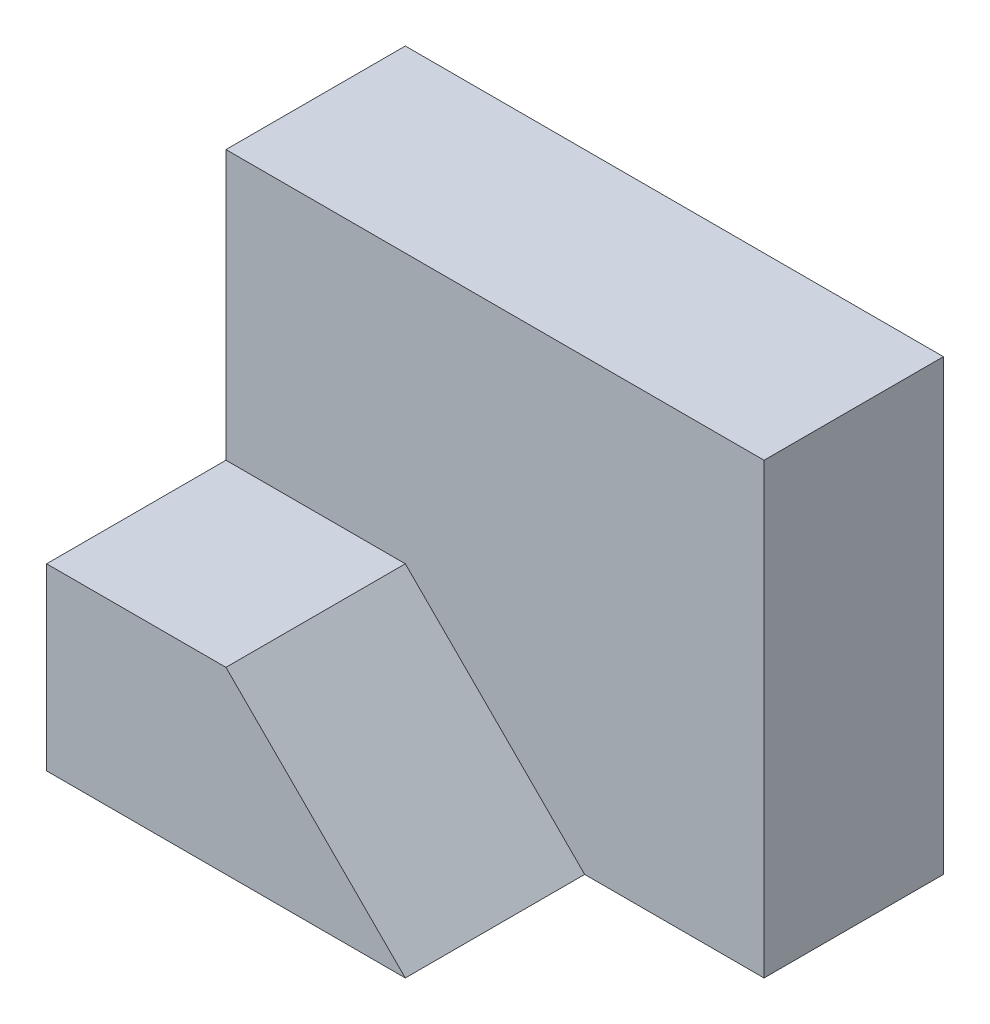
ISO-10303-21;
HEADER;
FILE_DESCRIPTION(('STEP AP214'),'2;1');
FILE_NAME('part.step','',(''),(''),'','','');
FILE_SCHEMA(('AUTOMOTIVE_DESIGN { 1 0 10303 214 1 1 1 1 }'));
ENDSEC;
DATA;
#1=APPLICATION_CONTEXT('core data for automotive mechanical design processes');
#2=APPLICATION_PROTOCOL_DEFINITION('international standard','automotive_design',2000,#1);
#3=PRODUCT_CONTEXT('',#1,'mechanical');
#4=PRODUCT('Part','Part','',(#3));
#5=PRODUCT_RELATED_PRODUCT_CATEGORY('part','',(#4));
#6=PRODUCT_DEFINITION_FORMATION('','',#4);
#7=PRODUCT_DEFINITION_CONTEXT('part definition',#1,'design');
#8=PRODUCT_DEFINITION('design','',#6,#7);
#9=PRODUCT_DEFINITION_SHAPE('','',#8);
#10=(LENGTH_UNIT() NAMED_UNIT(*) SI_UNIT(.MILLI.,.METRE.));
#11=(NAMED_UNIT(*) PLANE_ANGLE_UNIT() SI_UNIT($,.RADIAN.));
#12=(NAMED_UNIT(*) SI_UNIT($,.STERADIAN.) SOLID_ANGLE_UNIT());
#13=UNCERTAINTY_MEASURE_WITH_UNIT(LENGTH_MEASURE(1.E-05),#10,'distance_accuracy_value','');
#14=(GEOMETRIC_REPRESENTATION_CONTEXT(3) GLOBAL_UNCERTAINTY_ASSIGNED_CONTEXT((#13)) GLOBAL_UNIT_ASSIGNED_CONTEXT((#10,
#11,#12)) REPRESENTATION_CONTEXT('',''));
#15=CARTESIAN_POINT('',(0.,0.,0.));
#16=DIRECTION('',(0.,0.,1.));
#17=DIRECTION('',(1.,0.,0.));
#18=AXIS2_PLACEMENT_3D('',#15,#16,#17);
#19=CARTESIAN_POINT('',(0.,0.,2.));
#20=DIRECTION('',(0.,0.,-1.));
#21=DIRECTION('',(-1.,0.,0.));
#22=AXIS2_PLACEMENT_3D('',#19,#20,#21);
#23=PLANE('',#22);
#24=DIRECTION('',(-1.,0.,0.));
#25=VECTOR('',#24,1.);
#26=CARTESIAN_POINT('',(0.,2.,2.));
#27=LINE('',#26,#25);
#28=CARTESIAN_POINT('',(2.,2.,2.));
#29=VERTEX_POINT('',#28);
#30=CARTESIAN_POINT('',(0.,2.,2.));
#31=VERTEX_POINT('',#30);
#32=EDGE_CURVE('E111',#29,#31,#27,.T.);
#33=ORIENTED_EDGE('',*,*,#32,.F.);
#34=DIRECTION('',(-0.707106781186548,0.707106781186547,0.));
#35=VECTOR('',#34,1.);
#36=CARTESIAN_POINT('',(2.,2.,2.));
#37=LINE('',#36,#35);
#38=CARTESIAN_POINT('',(4.,0.,2.));
#39=VERTEX_POINT('',#38);
#40=EDGE_CURVE('E50',#39,#29,#37,.T.);
#41=ORIENTED_EDGE('',*,*,#40,.F.);
#42=DIRECTION('',(1.,0.,0.));
#43=VECTOR('',#42,1.);
#44=CARTESIAN_POINT('',(0.,0.,2.));
#45=LINE('',#44,#43);
#46=CARTESIAN_POINT('',(6.,0.,2.));
#47=VERTEX_POINT('',#46);
#48=EDGE_CURVE('E115',#39,#47,#45,.T.);
#49=ORIENTED_EDGE('',*,*,#48,.T.);
#50=DIRECTION('',(0.,1.,0.));
#51=VECTOR('',#50,1.);
#52=CARTESIAN_POINT('',(6.,0.,2.));
#53=LINE('',#52,#51);
#54=CARTESIAN_POINT('',(6.,5.,2.));
#55=VERTEX_POINT('',#54);
#56=EDGE_CURVE('E142',#47,#55,#53,.T.);
#57=ORIENTED_EDGE('',*,*,#56,.T.);
#58=DIRECTION('',(-1.,0.,0.));
#59=VECTOR('',#58,1.);
#60=CARTESIAN_POINT('',(0.,5.,2.));
#61=LINE('',#60,#59);
#62=CARTESIAN_POINT('',(0.,5.,2.));
#63=VERTEX_POINT('',#62);
#64=EDGE_CURVE('E168',#55,#63,#61,.T.);
#65=ORIENTED_EDGE('',*,*,#64,.T.);
#66=DIRECTION('',(0.,-1.,0.));
#67=VECTOR('',#66,1.);
#68=CARTESIAN_POINT('',(0.,0.,2.));
#69=LINE('',#68,#67);
#70=EDGE_CURVE('E56',#63,#31,#69,.T.);
#71=ORIENTED_EDGE('',*,*,#70,.T.);
#72=EDGE_LOOP('',(#33,#41,#49,#57,#65,#71));
#73=FACE_BOUND('',#72,.T.);
#74=ADVANCED_FACE('F33',(#73),#23,.F.);
#75=CARTESIAN_POINT('',(0.,0.,2.));
#76=DIRECTION('',(1.,0.,0.));
#77=DIRECTION('',(0.,0.,-1.));
#78=AXIS2_PLACEMENT_3D('',#75,#76,#77);
#79=PLANE('',#78);
#80=DIRECTION('',(0.,-1.,0.));
#81=VECTOR('',#80,1.);
#82=CARTESIAN_POINT('',(0.,0.,0.));
#83=LINE('',#82,#81);
#84=CARTESIAN_POINT('',(0.,5.,0.));
#85=VERTEX_POINT('',#84);
#86=CARTESIAN_POINT('',(0.,0.,0.));
#87=VERTEX_POINT('',#86);
#88=EDGE_CURVE('E116',#85,#87,#83,.T.);
#89=ORIENTED_EDGE('',*,*,#88,.T.);
#90=DIRECTION('',(0.,0.,-1.));
#91=VECTOR('',#90,1.);
#92=CARTESIAN_POINT('',(0.,0.,2.));
#93=LINE('',#92,#91);
#94=CARTESIAN_POINT('',(0.,0.,4.));
#95=VERTEX_POINT('',#94);
#96=EDGE_CURVE('E11',#95,#87,#93,.T.);
#97=ORIENTED_EDGE('',*,*,#96,.F.);
#98=DIRECTION('',(0.,-1.,0.));
#99=VECTOR('',#98,1.);
#100=CARTESIAN_POINT('',(0.,0.,4.));
#101=LINE('',#100,#99);
#102=CARTESIAN_POINT('',(0.,2.,4.));
#103=VERTEX_POINT('',#102);
#104=EDGE_CURVE('E109',#103,#95,#101,.T.);
#105=ORIENTED_EDGE('',*,*,#104,.F.);
#106=DIRECTION('',(0.,0.,-1.));
#107=VECTOR('',#106,1.);
#108=CARTESIAN_POINT('',(0.,2.,4.));
#109=LINE('',#108,#107);
#110=EDGE_CURVE('E121',#103,#31,#109,.T.);
#111=ORIENTED_EDGE('',*,*,#110,.T.);
#112=ORIENTED_EDGE('',*,*,#70,.F.);
#113=DIRECTION('',(0.,0.,-1.));
#114=VECTOR('',#113,1.);
#115=CARTESIAN_POINT('',(0.,5.,2.));
#116=LINE('',#115,#114);
#117=EDGE_CURVE('E166',#63,#85,#116,.T.);
#118=ORIENTED_EDGE('',*,*,#117,.T.);
#119=EDGE_LOOP('',(#89,#97,#105,#111,#112,#118));
#120=FACE_BOUND('',#119,.T.);
#121=ADVANCED_FACE('F35',(#120),#79,.F.);
#122=CARTESIAN_POINT('',(0.,0.,2.));
#123=DIRECTION('',(0.,1.,0.));
#124=DIRECTION('',(0.,0.,1.));
#125=AXIS2_PLACEMENT_3D('',#122,#123,#124);
#126=PLANE('',#125);
#127=DIRECTION('',(1.,0.,0.));
#128=VECTOR('',#127,1.);
#129=CARTESIAN_POINT('',(0.,0.,0.));
#130=LINE('',#129,#128);
#131=CARTESIAN_POINT('',(6.,0.,0.));
#132=VERTEX_POINT('',#131);
#133=EDGE_CURVE('E119',#87,#132,#130,.T.);
#134=ORIENTED_EDGE('',*,*,#133,.T.);
#135=DIRECTION('',(0.,0.,-1.));
#136=VECTOR('',#135,1.);
#137=CARTESIAN_POINT('',(6.,0.,2.));
#138=LINE('',#137,#136);
#139=EDGE_CURVE('E42',#47,#132,#138,.T.);
#140=ORIENTED_EDGE('',*,*,#139,.F.);
#141=ORIENTED_EDGE('',*,*,#48,.F.);
#142=DIRECTION('',(0.,0.,-1.));
#143=VECTOR('',#142,1.);
#144=CARTESIAN_POINT('',(4.,0.,4.));
#145=LINE('',#144,#143);
#146=CARTESIAN_POINT('',(4.,0.,4.));
#147=VERTEX_POINT('',#146);
#148=EDGE_CURVE('E97',#147,#39,#145,.T.);
#149=ORIENTED_EDGE('',*,*,#148,.F.);
#150=DIRECTION('',(1.,0.,0.));
#151=VECTOR('',#150,1.);
#152=CARTESIAN_POINT('',(4.,0.,4.));
#153=LINE('',#152,#151);
#154=EDGE_CURVE('E103',#95,#147,#153,.T.);
#155=ORIENTED_EDGE('',*,*,#154,.F.);
#156=ORIENTED_EDGE('',*,*,#96,.T.);
#157=EDGE_LOOP('',(#134,#140,#141,#149,#155,#156));
#158=FACE_BOUND('',#157,.T.);
#159=ADVANCED_FACE('F113',(#158),#126,.F.);
#160=CARTESIAN_POINT('',(6.,0.,2.));
#161=DIRECTION('',(-1.,0.,0.));
#162=DIRECTION('',(0.,0.,1.));
#163=AXIS2_PLACEMENT_3D('',#160,#161,#162);
#164=PLANE('',#163);
#165=DIRECTION('',(0.,1.,0.));
#166=VECTOR('',#165,1.);
#167=CARTESIAN_POINT('',(6.,0.,0.));
#168=LINE('',#167,#166);
#169=CARTESIAN_POINT('',(6.,5.,0.));
#170=VERTEX_POINT('',#169);
#171=EDGE_CURVE('E154',#132,#170,#168,.T.);
#172=ORIENTED_EDGE('',*,*,#171,.T.);
#173=DIRECTION('',(0.,0.,-1.));
#174=VECTOR('',#173,1.);
#175=CARTESIAN_POINT('',(6.,5.,2.));
#176=LINE('',#175,#174);
#177=EDGE_CURVE('E160',#55,#170,#176,.T.);
#178=ORIENTED_EDGE('',*,*,#177,.F.);
#179=ORIENTED_EDGE('',*,*,#56,.F.);
#180=ORIENTED_EDGE('',*,*,#139,.T.);
#181=EDGE_LOOP('',(#172,#178,#179,#180));
#182=FACE_BOUND('',#181,.T.);
#183=ADVANCED_FACE('F157',(#182),#164,.F.);
#184=CARTESIAN_POINT('',(0.,5.,2.));
#185=DIRECTION('',(0.,-1.,0.));
#186=DIRECTION('',(0.,0.,-1.));
#187=AXIS2_PLACEMENT_3D('',#184,#185,#186);
#188=PLANE('',#187);
#189=DIRECTION('',(-1.,0.,0.));
#190=VECTOR('',#189,1.);
#191=CARTESIAN_POINT('',(0.,5.,0.));
#192=LINE('',#191,#190);
#193=EDGE_CURVE('E140',#170,#85,#192,.T.);
#194=ORIENTED_EDGE('',*,*,#193,.T.);
#195=ORIENTED_EDGE('',*,*,#117,.F.);
#196=ORIENTED_EDGE('',*,*,#64,.F.);
#197=ORIENTED_EDGE('',*,*,#177,.T.);
#198=EDGE_LOOP('',(#194,#195,#196,#197));
#199=FACE_BOUND('',#198,.T.);
#200=ADVANCED_FACE('F171',(#199),#188,.F.);
#201=CARTESIAN_POINT('',(0.,0.,0.));
#202=DIRECTION('',(0.,0.,-1.));
#203=DIRECTION('',(-1.,0.,0.));
#204=AXIS2_PLACEMENT_3D('',#201,#202,#203);
#205=PLANE('',#204);
#206=ORIENTED_EDGE('',*,*,#88,.F.);
#207=ORIENTED_EDGE('',*,*,#193,.F.);
#208=ORIENTED_EDGE('',*,*,#171,.F.);
#209=ORIENTED_EDGE('',*,*,#133,.F.);
#210=EDGE_LOOP('',(#206,#207,#208,#209));
#211=FACE_BOUND('',#210,.T.);
#212=ADVANCED_FACE('F162',(#211),#205,.T.);
#213=CARTESIAN_POINT('',(2.,2.,4.));
#214=DIRECTION('',(-0.707106781186547,-0.707106781186548,0.));
#215=DIRECTION('',(0.707106781186548,-0.707106781186547,0.));
#216=AXIS2_PLACEMENT_3D('',#213,#214,#215);
#217=PLANE('',#216);
#218=ORIENTED_EDGE('',*,*,#40,.T.);
#219=DIRECTION('',(0.,0.,-1.));
#220=VECTOR('',#219,1.);
#221=CARTESIAN_POINT('',(2.,2.,4.));
#222=LINE('',#221,#220);
#223=CARTESIAN_POINT('',(2.,2.,4.));
#224=VERTEX_POINT('',#223);
#225=EDGE_CURVE('E99',#224,#29,#222,.T.);
#226=ORIENTED_EDGE('',*,*,#225,.F.);
#227=DIRECTION('',(-0.707106781186548,0.707106781186547,0.));
#228=VECTOR('',#227,1.);
#229=CARTESIAN_POINT('',(2.,2.,4.));
#230=LINE('',#229,#228);
#231=EDGE_CURVE('E93',#147,#224,#230,.T.);
#232=ORIENTED_EDGE('',*,*,#231,.F.);
#233=ORIENTED_EDGE('',*,*,#148,.T.);
#234=EDGE_LOOP('',(#218,#226,#232,#233));
#235=FACE_BOUND('',#234,.T.);
#236=ADVANCED_FACE('F95',(#235),#217,.F.);
#237=CARTESIAN_POINT('',(0.,2.,4.));
#238=DIRECTION('',(0.,-1.,0.));
#239=DIRECTION('',(0.,0.,-1.));
#240=AXIS2_PLACEMENT_3D('',#237,#238,#239);
#241=PLANE('',#240);
#242=ORIENTED_EDGE('',*,*,#32,.T.);
#243=ORIENTED_EDGE('',*,*,#110,.F.);
#244=DIRECTION('',(-1.,0.,0.));
#245=VECTOR('',#244,1.);
#246=CARTESIAN_POINT('',(0.,2.,4.));
#247=LINE('',#246,#245);
#248=EDGE_CURVE('E102',#224,#103,#247,.T.);
#249=ORIENTED_EDGE('',*,*,#248,.F.);
#250=ORIENTED_EDGE('',*,*,#225,.T.);
#251=EDGE_LOOP('',(#242,#243,#249,#250));
#252=FACE_BOUND('',#251,.T.);
#253=ADVANCED_FACE('F144',(#252),#241,.F.);
#254=CARTESIAN_POINT('',(0.,0.,4.));
#255=DIRECTION('',(0.,0.,-1.));
#256=DIRECTION('',(-1.,0.,0.));
#257=AXIS2_PLACEMENT_3D('',#254,#255,#256);
#258=PLANE('',#257);
#259=ORIENTED_EDGE('',*,*,#154,.T.);
#260=ORIENTED_EDGE('',*,*,#231,.T.);
#261=ORIENTED_EDGE('',*,*,#248,.T.);
#262=ORIENTED_EDGE('',*,*,#104,.T.);
#263=EDGE_LOOP('',(#259,#260,#261,#262));
#264=FACE_BOUND('',#263,.T.);
#265=ADVANCED_FACE('F107',(#264),#258,.F.);
#266=CLOSED_SHELL('',(#74,#121,#159,#183,#200,#212,#236,#253,#265));
#267=MANIFOLD_SOLID_BREP('B2',#266);
#268=ADVANCED_BREP_SHAPE_REPRESENTATION('',(#18,#267),#14);
#269=SHAPE_DEFINITION_REPRESENTATION(#9,#268);
ENDSEC;
END-ISO-10303-21;
